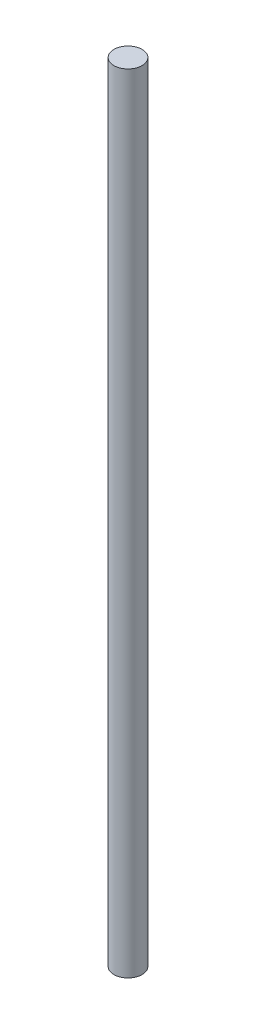
ISO-10303-21;
HEADER;
FILE_DESCRIPTION(('STEP AP214'),'2;1');
FILE_NAME('part.step','',(''),(''),'','','');
FILE_SCHEMA(('AUTOMOTIVE_DESIGN { 1 0 10303 214 1 1 1 1 }'));
ENDSEC;
DATA;
#1=APPLICATION_CONTEXT('core data for automotive mechanical design processes');
#2=APPLICATION_PROTOCOL_DEFINITION('international standard','automotive_design',2000,#1);
#3=PRODUCT_CONTEXT('',#1,'mechanical');
#4=PRODUCT('Part','Part','',(#3));
#5=PRODUCT_RELATED_PRODUCT_CATEGORY('part','',(#4));
#6=PRODUCT_DEFINITION_FORMATION('','',#4);
#7=PRODUCT_DEFINITION_CONTEXT('part definition',#1,'design');
#8=PRODUCT_DEFINITION('design','',#6,#7);
#9=PRODUCT_DEFINITION_SHAPE('','',#8);
#10=(LENGTH_UNIT() NAMED_UNIT(*) SI_UNIT(.MILLI.,.METRE.));
#11=(NAMED_UNIT(*) PLANE_ANGLE_UNIT() SI_UNIT($,.RADIAN.));
#12=(NAMED_UNIT(*) SI_UNIT($,.STERADIAN.) SOLID_ANGLE_UNIT());
#13=UNCERTAINTY_MEASURE_WITH_UNIT(LENGTH_MEASURE(1.E-05),#10,'distance_accuracy_value','');
#14=(GEOMETRIC_REPRESENTATION_CONTEXT(3) GLOBAL_UNCERTAINTY_ASSIGNED_CONTEXT((#13)) GLOBAL_UNIT_ASSIGNED_CONTEXT((#10,
#11,#12)) REPRESENTATION_CONTEXT('',''));
#15=CARTESIAN_POINT('',(0.,0.,0.));
#16=DIRECTION('',(0.,0.,1.));
#17=DIRECTION('',(1.,0.,0.));
#18=AXIS2_PLACEMENT_3D('',#15,#16,#17);
#19=CARTESIAN_POINT('',(0.,140.,0.));
#20=DIRECTION('',(0.,-1.,0.));
#21=DIRECTION('',(0.,0.,-1.));
#22=AXIS2_PLACEMENT_3D('',#19,#20,#21);
#23=CYLINDRICAL_SURFACE('',#22,2.5);
#24=CARTESIAN_POINT('',(0.,140.,0.));
#25=DIRECTION('',(0.,1.,0.));
#26=DIRECTION('',(0.,0.,1.));
#27=AXIS2_PLACEMENT_3D('',#24,#25,#26);
#28=CIRCLE('',#27,2.5);
#29=CARTESIAN_POINT('',(0.,140.,2.5));
#30=VERTEX_POINT('',#29);
#31=EDGE_CURVE('E10',#30,#30,#28,.T.);
#32=ORIENTED_EDGE('',*,*,#31,.F.);
#33=EDGE_LOOP('',(#32));
#34=FACE_BOUND('',#33,.T.);
#35=CARTESIAN_POINT('',(0.,0.,0.));
#36=DIRECTION('',(0.,1.,0.));
#37=DIRECTION('',(0.,0.,1.));
#38=AXIS2_PLACEMENT_3D('',#35,#36,#37);
#39=CIRCLE('',#38,2.5);
#40=CARTESIAN_POINT('',(0.,0.,2.5));
#41=VERTEX_POINT('',#40);
#42=EDGE_CURVE('E33',#41,#41,#39,.T.);
#43=ORIENTED_EDGE('',*,*,#42,.T.);
#44=EDGE_LOOP('',(#43));
#45=FACE_BOUND('',#44,.T.);
#46=ADVANCED_FACE('F30',(#34,#45),#23,.T.);
#47=CARTESIAN_POINT('',(0.,140.,0.));
#48=DIRECTION('',(0.,1.,0.));
#49=DIRECTION('',(0.,0.,1.));
#50=AXIS2_PLACEMENT_3D('',#47,#48,#49);
#51=PLANE('',#50);
#52=ORIENTED_EDGE('',*,*,#31,.T.);
#53=EDGE_LOOP('',(#52));
#54=FACE_BOUND('',#53,.T.);
#55=ADVANCED_FACE('F45',(#54),#51,.T.);
#56=CARTESIAN_POINT('',(0.,0.,0.));
#57=DIRECTION('',(0.,1.,0.));
#58=DIRECTION('',(0.,0.,1.));
#59=AXIS2_PLACEMENT_3D('',#56,#57,#58);
#60=PLANE('',#59);
#61=ORIENTED_EDGE('',*,*,#42,.F.);
#62=EDGE_LOOP('',(#61));
#63=FACE_BOUND('',#62,.T.);
#64=ADVANCED_FACE('F43',(#63),#60,.F.);
#65=CLOSED_SHELL('',(#46,#55,#64));
#66=MANIFOLD_SOLID_BREP('B2',#65);
#67=ADVANCED_BREP_SHAPE_REPRESENTATION('',(#18,#66),#14);
#68=SHAPE_DEFINITION_REPRESENTATION(#9,#67);
ENDSEC;
END-ISO-10303-21;
